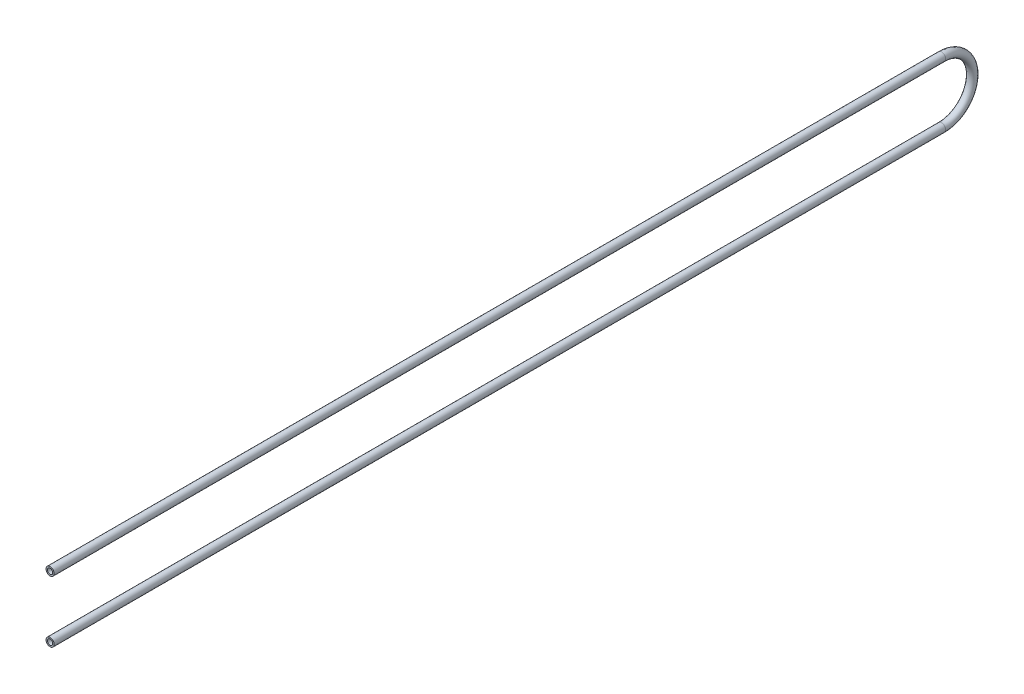
ISO-10303-21;
HEADER;
FILE_DESCRIPTION(('STEP AP214'),'2;1');
FILE_NAME('part.step','',(''),(''),'','','');
FILE_SCHEMA(('AUTOMOTIVE_DESIGN { 1 0 10303 214 1 1 1 1 }'));
ENDSEC;
DATA;
#1=APPLICATION_CONTEXT('core data for automotive mechanical design processes');
#2=APPLICATION_PROTOCOL_DEFINITION('international standard','automotive_design',2000,#1);
#3=PRODUCT_CONTEXT('',#1,'mechanical');
#4=PRODUCT('Part','Part','',(#3));
#5=PRODUCT_RELATED_PRODUCT_CATEGORY('part','',(#4));
#6=PRODUCT_DEFINITION_FORMATION('','',#4);
#7=PRODUCT_DEFINITION_CONTEXT('part definition',#1,'design');
#8=PRODUCT_DEFINITION('design','',#6,#7);
#9=PRODUCT_DEFINITION_SHAPE('','',#8);
#10=(LENGTH_UNIT() NAMED_UNIT(*) SI_UNIT(.MILLI.,.METRE.));
#11=(NAMED_UNIT(*) PLANE_ANGLE_UNIT() SI_UNIT($,.RADIAN.));
#12=(NAMED_UNIT(*) SI_UNIT($,.STERADIAN.) SOLID_ANGLE_UNIT());
#13=UNCERTAINTY_MEASURE_WITH_UNIT(LENGTH_MEASURE(1.E-05),#10,'distance_accuracy_value','');
#14=(GEOMETRIC_REPRESENTATION_CONTEXT(3) GLOBAL_UNCERTAINTY_ASSIGNED_CONTEXT((#13)) GLOBAL_UNIT_ASSIGNED_CONTEXT((#10,
#11,#12)) REPRESENTATION_CONTEXT('',''));
#15=CARTESIAN_POINT('',(0.,0.,0.));
#16=DIRECTION('',(0.,0.,1.));
#17=DIRECTION('',(1.,0.,0.));
#18=AXIS2_PLACEMENT_3D('',#15,#16,#17);
#19=CARTESIAN_POINT('',(0.,80.0000000000003,0.));
#20=DIRECTION('',(0.,0.,-1.));
#21=DIRECTION('',(0.,1.,0.));
#22=AXIS2_PLACEMENT_3D('',#19,#20,#21);
#23=CYLINDRICAL_SURFACE('',#22,10.65);
#24=CARTESIAN_POINT('',(0.,80.,-2325.));
#25=DIRECTION('',(0.,0.,1.));
#26=DIRECTION('',(1.,0.,0.));
#27=AXIS2_PLACEMENT_3D('',#24,#25,#26);
#28=CIRCLE('',#27,10.65);
#29=CARTESIAN_POINT('',(0.,90.65,-2325.));
#30=VERTEX_POINT('',#29);
#31=EDGE_CURVE('E55',#30,#30,#28,.T.);
#32=ORIENTED_EDGE('',*,*,#31,.T.);
#33=EDGE_LOOP('',(#32));
#34=FACE_BOUND('',#33,.T.);
#35=CARTESIAN_POINT('',(0.,80.0000000000003,0.));
#36=DIRECTION('',(0.,0.,1.));
#37=DIRECTION('',(1.,0.,0.));
#38=AXIS2_PLACEMENT_3D('',#35,#36,#37);
#39=CIRCLE('',#38,10.65);
#40=CARTESIAN_POINT('',(10.65,80.0000000000003,0.));
#41=VERTEX_POINT('',#40);
#42=EDGE_CURVE('E53',#41,#41,#39,.T.);
#43=ORIENTED_EDGE('',*,*,#42,.F.);
#44=EDGE_LOOP('',(#43));
#45=FACE_BOUND('',#44,.T.);
#46=ADVANCED_FACE('F32',(#34,#45),#23,.T.);
#47=CARTESIAN_POINT('',(0.,0.,-2325.));
#48=DIRECTION('',(-1.,0.,0.));
#49=DIRECTION('',(0.,0.,1.));
#50=AXIS2_PLACEMENT_3D('',#47,#48,#49);
#51=TOROIDAL_SURFACE('',#50,80.,10.65);
#52=CARTESIAN_POINT('',(0.,-80.,-2325.));
#53=DIRECTION('',(0.,0.,-1.));
#54=DIRECTION('',(1.,0.,0.));
#55=AXIS2_PLACEMENT_3D('',#52,#53,#54);
#56=CIRCLE('',#55,10.65);
#57=CARTESIAN_POINT('',(0.,-90.65,-2325.));
#58=VERTEX_POINT('',#57);
#59=EDGE_CURVE('E36',#58,#58,#56,.T.);
#60=CARTESIAN_POINT('',(0.,0.,-2325.));
#61=DIRECTION('',(-1.,0.,0.));
#62=DIRECTION('',(0.,0.,1.));
#63=AXIS2_PLACEMENT_3D('',#60,#61,#62);
#64=CIRCLE('',#63,90.65);
#65=EDGE_CURVE('',#30,#58,#64,.T.);
#66=ORIENTED_EDGE('',*,*,#31,.F.);
#67=ORIENTED_EDGE('',*,*,#59,.T.);
#68=ORIENTED_EDGE('',*,*,#65,.T.);
#69=ORIENTED_EDGE('',*,*,#65,.F.);
#70=EDGE_LOOP('',(#66,#68,#67,#69));
#71=FACE_BOUND('',#70,.T.);
#72=ADVANCED_FACE('F62',(#71),#51,.T.);
#73=CARTESIAN_POINT('',(0.,-80.,-2325.));
#74=DIRECTION('',(0.,0.,1.));
#75=DIRECTION('',(0.,-1.,0.));
#76=AXIS2_PLACEMENT_3D('',#73,#74,#75);
#77=CYLINDRICAL_SURFACE('',#76,10.65);
#78=CARTESIAN_POINT('',(0.,-80.0000000000003,0.));
#79=DIRECTION('',(0.,0.,-1.));
#80=DIRECTION('',(1.,0.,0.));
#81=AXIS2_PLACEMENT_3D('',#78,#79,#80);
#82=CIRCLE('',#81,10.65);
#83=CARTESIAN_POINT('',(10.65,-80.0000000000003,0.));
#84=VERTEX_POINT('',#83);
#85=EDGE_CURVE('E49',#84,#84,#82,.T.);
#86=ORIENTED_EDGE('',*,*,#85,.T.);
#87=EDGE_LOOP('',(#86));
#88=FACE_BOUND('',#87,.T.);
#89=ORIENTED_EDGE('',*,*,#59,.F.);
#90=EDGE_LOOP('',(#89));
#91=FACE_BOUND('',#90,.T.);
#92=ADVANCED_FACE('F34',(#88,#91),#77,.T.);
#93=CARTESIAN_POINT('',(0.,80.0000000000003,0.));
#94=DIRECTION('',(0.,0.,1.));
#95=DIRECTION('',(1.,0.,0.));
#96=AXIS2_PLACEMENT_3D('',#93,#94,#95);
#97=PLANE('',#96);
#98=CARTESIAN_POINT('',(0.,80.0000000000003,0.));
#99=DIRECTION('',(0.,0.,1.));
#100=DIRECTION('',(1.,0.,0.));
#101=AXIS2_PLACEMENT_3D('',#98,#99,#100);
#102=CIRCLE('',#101,6.92);
#103=CARTESIAN_POINT('',(6.92,80.0000000000003,0.));
#104=VERTEX_POINT('',#103);
#105=EDGE_CURVE('E52',#104,#104,#102,.F.);
#106=ORIENTED_EDGE('',*,*,#105,.T.);
#107=EDGE_LOOP('',(#106));
#108=FACE_BOUND('',#107,.T.);
#109=ORIENTED_EDGE('',*,*,#42,.T.);
#110=EDGE_LOOP('',(#109));
#111=FACE_BOUND('',#110,.T.);
#112=ADVANCED_FACE('F66',(#108,#111),#97,.T.);
#113=CARTESIAN_POINT('',(0.,-80.0000000000003,0.));
#114=DIRECTION('',(0.,0.,-1.));
#115=DIRECTION('',(1.,0.,0.));
#116=AXIS2_PLACEMENT_3D('',#113,#114,#115);
#117=PLANE('',#116);
#118=CARTESIAN_POINT('',(0.,-80.0000000000003,0.));
#119=DIRECTION('',(0.,0.,-1.));
#120=DIRECTION('',(1.,0.,0.));
#121=AXIS2_PLACEMENT_3D('',#118,#119,#120);
#122=CIRCLE('',#121,6.92);
#123=CARTESIAN_POINT('',(6.92,-80.0000000000003,0.));
#124=VERTEX_POINT('',#123);
#125=EDGE_CURVE('E10',#124,#124,#122,.F.);
#126=ORIENTED_EDGE('',*,*,#125,.F.);
#127=EDGE_LOOP('',(#126));
#128=FACE_BOUND('',#127,.T.);
#129=ORIENTED_EDGE('',*,*,#85,.F.);
#130=EDGE_LOOP('',(#129));
#131=FACE_BOUND('',#130,.T.);
#132=ADVANCED_FACE('F72',(#128,#131),#117,.F.);
#133=CARTESIAN_POINT('',(0.,80.0000000000003,0.));
#134=DIRECTION('',(0.,0.,-1.));
#135=DIRECTION('',(0.,1.,0.));
#136=AXIS2_PLACEMENT_3D('',#133,#134,#135);
#137=CYLINDRICAL_SURFACE('',#136,6.92);
#138=CARTESIAN_POINT('',(0.,80.,-2325.));
#139=DIRECTION('',(0.,0.,1.));
#140=DIRECTION('',(1.,0.,0.));
#141=AXIS2_PLACEMENT_3D('',#138,#139,#140);
#142=CIRCLE('',#141,6.92);
#143=CARTESIAN_POINT('',(0.,86.92,-2325.));
#144=VERTEX_POINT('',#143);
#145=EDGE_CURVE('E45',#144,#144,#142,.F.);
#146=ORIENTED_EDGE('',*,*,#145,.T.);
#147=EDGE_LOOP('',(#146));
#148=FACE_BOUND('',#147,.T.);
#149=ORIENTED_EDGE('',*,*,#105,.F.);
#150=EDGE_LOOP('',(#149));
#151=FACE_BOUND('',#150,.T.);
#152=ADVANCED_FACE('F82',(#148,#151),#137,.F.);
#153=CARTESIAN_POINT('',(0.,0.,-2325.));
#154=DIRECTION('',(-1.,0.,0.));
#155=DIRECTION('',(0.,0.,1.));
#156=AXIS2_PLACEMENT_3D('',#153,#154,#155);
#157=TOROIDAL_SURFACE('',#156,80.,6.92);
#158=CARTESIAN_POINT('',(0.,-80.,-2325.));
#159=DIRECTION('',(0.,0.,-1.));
#160=DIRECTION('',(1.,0.,0.));
#161=AXIS2_PLACEMENT_3D('',#158,#159,#160);
#162=CIRCLE('',#161,6.92);
#163=CARTESIAN_POINT('',(0.,-86.92,-2325.));
#164=VERTEX_POINT('',#163);
#165=EDGE_CURVE('E40',#164,#164,#162,.F.);
#166=CARTESIAN_POINT('',(0.,0.,-2325.));
#167=DIRECTION('',(-1.,0.,0.));
#168=DIRECTION('',(0.,0.,1.));
#169=AXIS2_PLACEMENT_3D('',#166,#167,#168);
#170=CIRCLE('',#169,86.92);
#171=EDGE_CURVE('',#144,#164,#170,.T.);
#172=ORIENTED_EDGE('',*,*,#145,.F.);
#173=ORIENTED_EDGE('',*,*,#165,.T.);
#174=ORIENTED_EDGE('',*,*,#171,.T.);
#175=ORIENTED_EDGE('',*,*,#171,.F.);
#176=EDGE_LOOP('',(#172,#174,#173,#175));
#177=FACE_BOUND('',#176,.T.);
#178=ADVANCED_FACE('F77',(#177),#157,.F.);
#179=CARTESIAN_POINT('',(0.,-80.,-2325.));
#180=DIRECTION('',(0.,0.,1.));
#181=DIRECTION('',(0.,-1.,0.));
#182=AXIS2_PLACEMENT_3D('',#179,#180,#181);
#183=CYLINDRICAL_SURFACE('',#182,6.92);
#184=ORIENTED_EDGE('',*,*,#125,.T.);
#185=EDGE_LOOP('',(#184));
#186=FACE_BOUND('',#185,.T.);
#187=ORIENTED_EDGE('',*,*,#165,.F.);
#188=EDGE_LOOP('',(#187));
#189=FACE_BOUND('',#188,.T.);
#190=ADVANCED_FACE('F75',(#186,#189),#183,.F.);
#191=CLOSED_SHELL('',(#46,#72,#92,#112,#132,#152,#178,#190));
#192=MANIFOLD_SOLID_BREP('B2',#191);
#193=ADVANCED_BREP_SHAPE_REPRESENTATION('',(#18,#192),#14);
#194=SHAPE_DEFINITION_REPRESENTATION(#9,#193);
ENDSEC;
END-ISO-10303-21;
